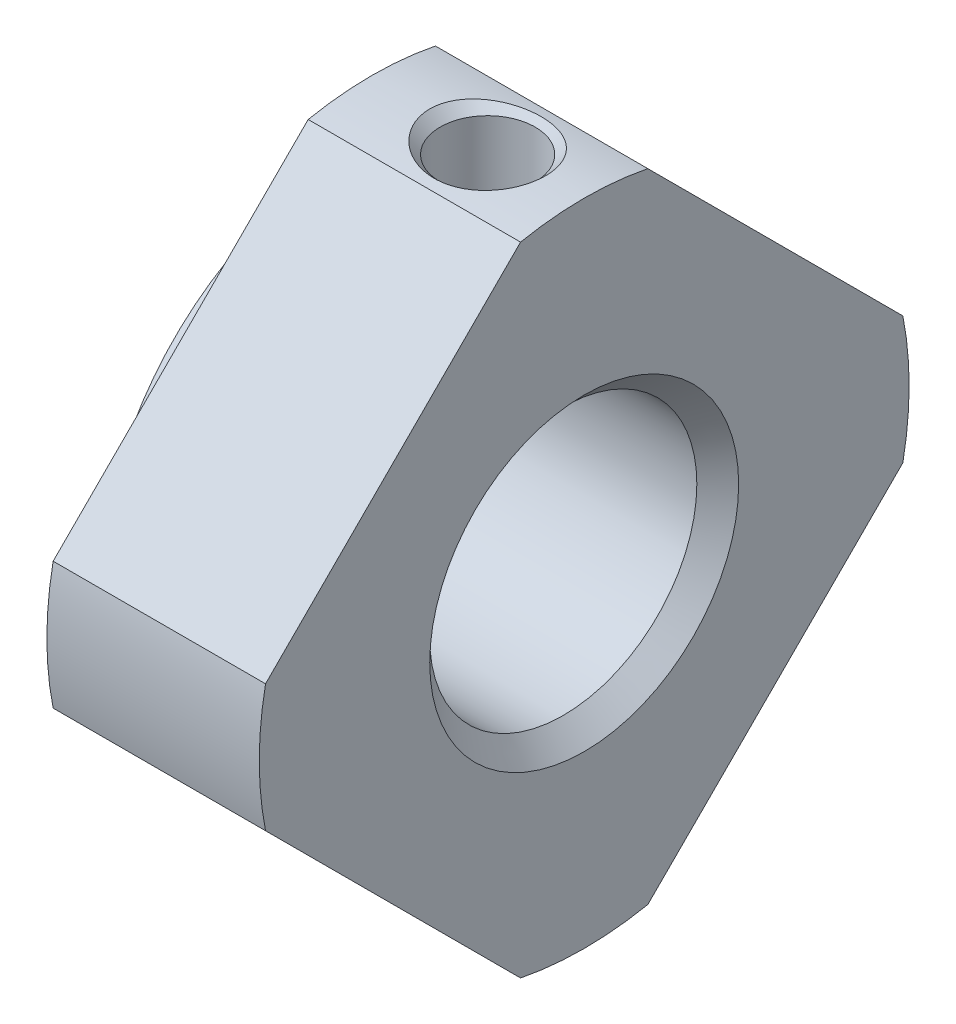
ISO-10303-21;
HEADER;
FILE_DESCRIPTION(('STEP AP214'),'2;1');
FILE_NAME('part.step','',(''),(''),'','','');
FILE_SCHEMA(('AUTOMOTIVE_DESIGN { 1 0 10303 214 1 1 1 1 }'));
ENDSEC;
DATA;
#1=APPLICATION_CONTEXT('core data for automotive mechanical design processes');
#2=APPLICATION_PROTOCOL_DEFINITION('international standard','automotive_design',2000,#1);
#3=PRODUCT_CONTEXT('',#1,'mechanical');
#4=PRODUCT('Part','Part','',(#3));
#5=PRODUCT_RELATED_PRODUCT_CATEGORY('part','',(#4));
#6=PRODUCT_DEFINITION_FORMATION('','',#4);
#7=PRODUCT_DEFINITION_CONTEXT('part definition',#1,'design');
#8=PRODUCT_DEFINITION('design','',#6,#7);
#9=PRODUCT_DEFINITION_SHAPE('','',#8);
#10=(LENGTH_UNIT() NAMED_UNIT(*) SI_UNIT(.MILLI.,.METRE.));
#11=(NAMED_UNIT(*) PLANE_ANGLE_UNIT() SI_UNIT($,.RADIAN.));
#12=(NAMED_UNIT(*) SI_UNIT($,.STERADIAN.) SOLID_ANGLE_UNIT());
#13=UNCERTAINTY_MEASURE_WITH_UNIT(LENGTH_MEASURE(1.E-05),#10,'distance_accuracy_value','');
#14=(GEOMETRIC_REPRESENTATION_CONTEXT(3) GLOBAL_UNCERTAINTY_ASSIGNED_CONTEXT((#13)) GLOBAL_UNIT_ASSIGNED_CONTEXT((#10,
#11,#12)) REPRESENTATION_CONTEXT('',''));
#15=CARTESIAN_POINT('',(0.,0.,0.));
#16=DIRECTION('',(0.,0.,1.));
#17=DIRECTION('',(1.,0.,0.));
#18=AXIS2_PLACEMENT_3D('',#15,#16,#17);
#19=CARTESIAN_POINT('',(24.,2.29809703885628,-2.29809703885628));
#20=DIRECTION('',(-1.,0.,0.));
#21=DIRECTION('',(0.,0.,1.));
#22=AXIS2_PLACEMENT_3D('',#19,#20,#21);
#23=PLANE('',#22);
#24=CARTESIAN_POINT('',(24.,0.,0.));
#25=DIRECTION('',(1.,0.,0.));
#26=DIRECTION('',(0.,0.,-1.));
#27=AXIS2_PLACEMENT_3D('',#24,#25,#26);
#28=CIRCLE('',#27,6.5);
#29=CARTESIAN_POINT('',(24.,0.,-6.5));
#30=VERTEX_POINT('',#29);
#31=EDGE_CURVE('E128',#30,#30,#28,.T.);
#32=ORIENTED_EDGE('',*,*,#31,.F.);
#33=EDGE_LOOP('',(#32));
#34=FACE_BOUND('',#33,.T.);
#35=CARTESIAN_POINT('',(24.0000000000578,0.,0.));
#36=DIRECTION('',(-1.,0.,0.));
#37=DIRECTION('',(0.,0.,1.));
#38=AXIS2_PLACEMENT_3D('',#35,#36,#37);
#39=CIRCLE('',#38,3.99999999999135);
#40=CARTESIAN_POINT('',(24.0000000000578,0.,3.99999999999135));
#41=VERTEX_POINT('',#40);
#42=EDGE_CURVE('E19',#41,#41,#39,.F.);
#43=ORIENTED_EDGE('',*,*,#42,.T.);
#44=EDGE_LOOP('',(#43));
#45=FACE_BOUND('',#44,.T.);
#46=ADVANCED_FACE('F16',(#34,#45),#23,.T.);
#47=CARTESIAN_POINT('',(24.0000000000578,0.,0.));
#48=DIRECTION('',(-1.,0.,0.));
#49=DIRECTION('',(0.,0.,1.));
#50=AXIS2_PLACEMENT_3D('',#47,#48,#49);
#51=CONICAL_SURFACE('',#50,3.99999999999135,0.785398163404676);
#52=CARTESIAN_POINT('',(24.5415,0.,0.));
#53=DIRECTION('',(1.,0.,0.));
#54=DIRECTION('',(0.,0.,-1.));
#55=AXIS2_PLACEMENT_3D('',#52,#53,#54);
#56=CIRCLE('',#55,3.4585);
#57=CARTESIAN_POINT('',(24.5415,0.,-3.4585));
#58=VERTEX_POINT('',#57);
#59=EDGE_CURVE('E126',#58,#58,#56,.T.);
#60=ORIENTED_EDGE('',*,*,#59,.T.);
#61=EDGE_LOOP('',(#60));
#62=FACE_BOUND('',#61,.T.);
#63=ORIENTED_EDGE('',*,*,#42,.F.);
#64=EDGE_LOOP('',(#63));
#65=FACE_BOUND('',#64,.T.);
#66=ADVANCED_FACE('F218',(#62,#65),#51,.F.);
#67=CARTESIAN_POINT('',(27.5,4.07203534805996,0.));
#68=DIRECTION('',(0.,-1.,0.));
#69=DIRECTION('',(0.,0.,-1.));
#70=AXIS2_PLACEMENT_3D('',#67,#68,#69);
#71=CYLINDRICAL_SURFACE('',#70,1.2295);
#72=CARTESIAN_POINT('',(28.7295,3.4585,0.));
#73=CARTESIAN_POINT('',(28.7294972532803,3.45849792901081,0.0667731705723019));
#74=CARTESIAN_POINT('',(28.724038134659,3.45654674055166,0.133577836929496));
#75=CARTESIAN_POINT('',(28.7024045018354,3.44894613652417,0.265241850890497));
#76=CARTESIAN_POINT('',(28.6862210016734,3.44329361965978,0.330099519426294));
#77=CARTESIAN_POINT('',(28.6437777582326,3.42890415188961,0.455894626995671));
#78=CARTESIAN_POINT('',(28.6175398105906,3.4201738760821,0.516840215139463));
#79=CARTESIAN_POINT('',(28.5558235340233,3.400509097644,0.63345225756244));
#80=CARTESIAN_POINT('',(28.5203444738172,3.3895744205871,0.689118293576919));
#81=CARTESIAN_POINT('',(28.4397084634739,3.36616491110564,0.795765124223505));
#82=CARTESIAN_POINT('',(28.3942561931314,3.35364956220271,0.846513677818602));
#83=CARTESIAN_POINT('',(28.2955905373628,3.32869957370831,0.939851074535168));
#84=CARTESIAN_POINT('',(28.2423749672851,3.31626495786794,0.982437612972421));
#85=CARTESIAN_POINT('',(28.1275158227201,3.29242672630858,1.05964105169358));
#86=CARTESIAN_POINT('',(28.0656496598687,3.28107159287441,1.09394324003043));
#87=CARTESIAN_POINT('',(27.9365581720018,3.2613001892905,1.1515545811353));
#88=CARTESIAN_POINT('',(27.8693347502231,3.25288288110636,1.17486761777019));
#89=CARTESIAN_POINT('',(27.7340917198755,3.2403693495768,1.20894543878393));
#90=CARTESIAN_POINT('',(27.6661970446325,3.23612257939152,1.22014900260984));
#91=CARTESIAN_POINT('',(27.5293688411667,3.23198796470078,1.23106191996937));
#92=CARTESIAN_POINT('',(27.4604356969162,3.23209854678288,1.23077542249103));
#93=CARTESIAN_POINT('',(27.3273662995864,3.23653530488158,1.21905432437841));
#94=CARTESIAN_POINT('',(27.2631692305767,3.24063810488675,1.20821042313127));
#95=CARTESIAN_POINT('',(27.1375732923528,3.25222856032938,1.17665256593067));
#96=CARTESIAN_POINT('',(27.0761748136911,3.25971668661784,1.15593723697959));
#97=CARTESIAN_POINT('',(26.9566480614102,3.27738039950413,1.10487030876405));
#98=CARTESIAN_POINT('',(26.8985967149501,3.28760112315905,1.07435494994134));
#99=CARTESIAN_POINT('',(26.7882627190975,3.30956085333351,1.00466954617846));
#100=CARTESIAN_POINT('',(26.7359816334106,3.32130026954647,0.965497163830239));
#101=CARTESIAN_POINT('',(26.6353818650582,3.34583228409178,0.876848941269146));
#102=CARTESIAN_POINT('',(26.5874867427625,3.35864589412237,0.826897229186064));
#103=CARTESIAN_POINT('',(26.500618524966,3.38327886557056,0.719498429300797));
#104=CARTESIAN_POINT('',(26.4616494332354,3.39509777931954,0.66204799601477));
#105=CARTESIAN_POINT('',(26.3933318281954,3.41660634979102,0.540273292543376));
#106=CARTESIAN_POINT('',(26.3641182604401,3.42626557413439,0.475867713273768));
#107=CARTESIAN_POINT('',(26.3171243795775,3.44212897844173,0.342695279100977));
#108=CARTESIAN_POINT('',(26.2993207958757,3.44834018712678,0.273937617159644));
#109=CARTESIAN_POINT('',(26.2818900730337,3.45446393024296,0.170440764568077));
#110=CARTESIAN_POINT('',(26.2776245751146,3.45597260725247,0.136516662067763));
#111=CARTESIAN_POINT('',(26.2719285589479,3.45799136740286,0.0684007779391334));
#112=CARTESIAN_POINT('',(26.2704980439418,3.45850144940194,0.0342089960047987));
#113=CARTESIAN_POINT('',(26.270503815498,3.45849717278851,-0.0667282579116665));
#114=CARTESIAN_POINT('',(26.2759579858041,3.45654803915553,-0.133522012986982));
#115=CARTESIAN_POINT('',(26.2975830028654,3.4489505922801,-0.265198067312143));
#116=CARTESIAN_POINT('',(26.3137709156948,3.4432963883434,-0.330077150475864));
#117=CARTESIAN_POINT('',(26.3562242731041,3.42890343483669,-0.455899064728556));
#118=CARTESIAN_POINT('',(26.3824650369959,3.42017224372993,-0.516851112274362));
#119=CARTESIAN_POINT('',(26.4441830338479,3.40050709248224,-0.633462928077768));
#120=CARTESIAN_POINT('',(26.4796592950033,3.38957336413056,-0.689123252315939));
#121=CARTESIAN_POINT('',(26.5602874489948,3.36616605876869,-0.795759744869848));
#122=CARTESIAN_POINT('',(26.6057345525074,3.35365197850508,-0.84650375759909));
#123=CARTESIAN_POINT('',(26.7043995687903,3.32870199987503,-0.939842881106358));
#124=CARTESIAN_POINT('',(26.7576211659347,3.31626614150923,-0.982434106000977));
#125=CARTESIAN_POINT('',(26.872509395562,3.29242109840042,-1.05965894098772));
#126=CARTESIAN_POINT('',(26.9344010058861,3.28106095286757,-1.09397416905596));
#127=CARTESIAN_POINT('',(27.0635104483576,3.26129255332198,-1.15157689373538));
#128=CARTESIAN_POINT('',(27.1307213970111,3.25288055840637,-1.17487837885786));
#129=CARTESIAN_POINT('',(27.2485165339642,3.24197650156783,-1.20456556549756));
#130=CARTESIAN_POINT('',(27.2982840502899,3.23847576468749,-1.21389504508542));
#131=CARTESIAN_POINT('',(27.3986949942306,3.2337749800511,-1.2263629946906));
#132=CARTESIAN_POINT('',(27.4493383208971,3.23257466890149,-1.22950217348457));
#133=CARTESIAN_POINT('',(27.5666230568127,3.23257932754768,-1.22949714174128));
#134=CARTESIAN_POINT('',(27.6332778519265,3.23466124573477,-1.22406169769771));
#135=CARTESIAN_POINT('',(27.7646297333065,3.24272545124204,-1.20253067989141));
#136=CARTESIAN_POINT('',(27.829325015771,3.24871122446087,-1.18642557858791));
#137=CARTESIAN_POINT('',(27.9547758487751,3.26381686880246,-1.14421099940331));
#138=CARTESIAN_POINT('',(28.0155408685309,3.27292884606487,-1.11812670070685));
#139=CARTESIAN_POINT('',(28.1318424619876,3.29324938071436,-1.05677387021534));
#140=CARTESIAN_POINT('',(28.1873785396001,3.30445813672953,-1.02150446819018));
#141=CARTESIAN_POINT('',(28.2941351726388,3.32827028660199,-0.941097155122366));
#142=CARTESIAN_POINT('',(28.345089820728,3.34091178009758,-0.895617391752426));
#143=CARTESIAN_POINT('',(28.4388427246348,3.3658477447303,-0.79679676389439));
#144=CARTESIAN_POINT('',(28.4816379752725,3.37814208659356,-0.743453015806719));
#145=CARTESIAN_POINT('',(28.5591044385083,3.40144759177939,-0.628427336918348));
#146=CARTESIAN_POINT('',(28.5934879281613,3.41240815681634,-0.566540653240623));
#147=CARTESIAN_POINT('',(28.6512185317241,3.4313419198717,-0.437438398122883));
#148=CARTESIAN_POINT('',(28.6745789212471,3.43931870897152,-0.370229351210259));
#149=CARTESIAN_POINT('',(28.7044054217375,3.4496397150729,-0.252285710907674));
#150=CARTESIAN_POINT('',(28.7137954674046,3.45294327339789,-0.202355400392088));
#151=CARTESIAN_POINT('',(28.7263435206443,3.45737410578969,-0.101622755274349));
#152=CARTESIAN_POINT('',(28.7295020905053,3.45850157621249,-0.0508204997682175));
#153=CARTESIAN_POINT('',(28.7295,3.4585,0.));
#154=B_SPLINE_CURVE_WITH_KNOTS('',3,(#72,#73,#74,#75,#76,#77,#78,#79,#80,#81,#82,#83,#84,#85,
#86,#87,#88,#89,#90,#91,#92,#93,#94,#95,#96,#97,#98,#99,#100,#101,#102,#103,#104,#105,#106,#107,
#108,#109,#110,#111,#112,#113,#114,#115,#116,#117,#118,#119,#120,#121,#122,#123,#124,#125,#126,
#127,#128,#129,#130,#131,#132,#133,#134,#135,#136,#137,#138,#139,#140,#141,#142,#143,#144,#145,
#146,#147,#148,#149,#150,#151,#152,#153),.UNSPECIFIED.,.T.,.F.,(4,2,2,2,2,2,2,2,2,2,2,2,2,2,2,2,
2,2,2,2,2,2,2,2,2,2,2,2,2,2,2,2,2,2,2,2,2,2,2,2,4),(0.,0.2001279857794,0.400423871193028,
0.600287997042275,0.800167943628057,1.00704524164594,1.21398086921195,1.42784762282295,
1.64163873329317,1.84739279914525,2.05307256918222,2.24786888036255,2.44269229329334,
2.64095724228983,2.83927578863519,3.04944697659925,3.25971225301992,3.47277600328787,
3.68540381670686,3.7879628857598,3.89052207207871,4.09057459144931,4.29094594872797,
4.49082849588913,4.69069001891412,4.89754730625148,5.104502944319,5.3184681305512,
5.53216082531669,5.68401679445202,5.83585537538258,6.03553194715906,6.23538706220654,
6.43474120010549,6.63411423241683,6.84156267863256,7.04908738301567,7.26294409436827,
7.47654258696946,7.62887206335164,7.78118779387252),.UNSPECIFIED.);
#155=CARTESIAN_POINT('',(28.7295,3.4585,0.));
#156=VERTEX_POINT('',#155);
#157=EDGE_CURVE('E125',#156,#156,#154,.T.);
#158=ORIENTED_EDGE('',*,*,#157,.T.);
#159=EDGE_LOOP('',(#158));
#160=FACE_BOUND('',#159,.T.);
#161=CARTESIAN_POINT('',(27.5,8.14407069606204,0.));
#162=DIRECTION('',(0.,1.,0.));
#163=DIRECTION('',(1.,0.,0.));
#164=AXIS2_PLACEMENT_3D('',#161,#162,#163);
#165=CIRCLE('',#164,1.22949999994034);
#166=CARTESIAN_POINT('',(28.7294999999403,8.14407069606204,0.));
#167=VERTEX_POINT('',#166);
#168=EDGE_CURVE('E122',#167,#167,#165,.T.);
#169=ORIENTED_EDGE('',*,*,#168,.T.);
#170=EDGE_LOOP('',(#169));
#171=FACE_BOUND('',#170,.T.);
#172=ADVANCED_FACE('F221',(#160,#171),#71,.F.);
#173=CARTESIAN_POINT('',(24.25,0.,0.));
#174=DIRECTION('',(1.,0.,0.));
#175=DIRECTION('',(0.,0.,-1.));
#176=AXIS2_PLACEMENT_3D('',#173,#174,#175);
#177=CYLINDRICAL_SURFACE('',#176,6.5);
#178=ORIENTED_EDGE('',*,*,#31,.T.);
#179=EDGE_LOOP('',(#178));
#180=FACE_BOUND('',#179,.T.);
#181=CARTESIAN_POINT('',(24.5,0.,0.));
#182=DIRECTION('',(1.,0.,0.));
#183=DIRECTION('',(0.,0.,-1.));
#184=AXIS2_PLACEMENT_3D('',#181,#182,#183);
#185=CIRCLE('',#184,6.5);
#186=CARTESIAN_POINT('',(24.5,0.,-6.5));
#187=VERTEX_POINT('',#186);
#188=EDGE_CURVE('E121',#187,#187,#185,.T.);
#189=ORIENTED_EDGE('',*,*,#188,.F.);
#190=EDGE_LOOP('',(#189));
#191=FACE_BOUND('',#190,.T.);
#192=ADVANCED_FACE('F212',(#180,#191),#177,.T.);
#193=CARTESIAN_POINT('',(27.,0.,0.));
#194=DIRECTION('',(1.,0.,0.));
#195=DIRECTION('',(0.,0.,-1.));
#196=AXIS2_PLACEMENT_3D('',#193,#194,#195);
#197=CYLINDRICAL_SURFACE('',#196,3.4585);
#198=CARTESIAN_POINT('',(29.4584999999756,0.,0.));
#199=DIRECTION('',(1.,0.,0.));
#200=DIRECTION('',(0.,0.70710678117833,-0.707106781194765));
#201=AXIS2_PLACEMENT_3D('',#198,#199,#200);
#202=CIRCLE('',#201,3.45849999998644);
#203=CARTESIAN_POINT('',(29.4584999999756,2.44552880269566,-2.44552880275251));
#204=VERTEX_POINT('',#203);
#205=EDGE_CURVE('E115',#204,#204,#202,.T.);
#206=ORIENTED_EDGE('',*,*,#205,.T.);
#207=EDGE_LOOP('',(#206));
#208=FACE_BOUND('',#207,.T.);
#209=ORIENTED_EDGE('',*,*,#157,.F.);
#210=EDGE_LOOP('',(#209));
#211=FACE_BOUND('',#210,.T.);
#212=ORIENTED_EDGE('',*,*,#59,.F.);
#213=EDGE_LOOP('',(#212));
#214=FACE_BOUND('',#213,.T.);
#215=ADVANCED_FACE('F192',(#208,#211,#214),#197,.F.);
#216=CARTESIAN_POINT('',(27.5,8.41619369595037,0.));
#217=DIRECTION('',(0.,1.,0.));
#218=DIRECTION('',(0.,0.,1.));
#219=AXIS2_PLACEMENT_3D('',#216,#217,#218);
#220=CONICAL_SURFACE('',#219,1.50162299982867,0.785398163397448);
#221=ORIENTED_EDGE('',*,*,#168,.F.);
#222=EDGE_LOOP('',(#221));
#223=FACE_BOUND('',#222,.T.);
#224=CARTESIAN_POINT('',(28.9999999999982,8.41457069611991,0.));
#225=CARTESIAN_POINT('',(28.9999902634013,8.41456799800857,0.074642129056308));
#226=CARTESIAN_POINT('',(28.9933972776143,8.41356516564388,0.149365889602182));
#227=CARTESIAN_POINT('',(28.9672952219709,8.4096664970959,0.296589883068127));
#228=CARTESIAN_POINT('',(28.9477570766986,8.40676639975459,0.369084725304883));
#229=CARTESIAN_POINT('',(28.897797110846,8.39958373900764,0.506474742444062));
#230=CARTESIAN_POINT('',(28.8678971970176,8.39536829435643,0.5715644433938));
#231=CARTESIAN_POINT('',(28.7982640300876,8.3859607311955,0.696109068163341));
#232=CARTESIAN_POINT('',(28.7585347379957,8.38076900630561,0.755566248443076));
#233=CARTESIAN_POINT('',(28.6678537663505,8.36957260828114,0.871107640923128));
#234=CARTESIAN_POINT('',(28.6163678364953,8.36353773424782,0.926768981076624));
#235=CARTESIAN_POINT('',(28.5053779364112,8.35152349314025,1.02943350705764));
#236=CARTESIAN_POINT('',(28.4458702836478,8.34554415291549,1.07643269275044));
#237=CARTESIAN_POINT('',(28.3153687963381,8.33374270679312,1.16441594622871));
#238=CARTESIAN_POINT('',(28.2438354015427,8.32797233085831,1.20460729140951));
#239=CARTESIAN_POINT('',(28.0952683742144,8.31774996974431,1.27328073946239));
#240=CARTESIAN_POINT('',(28.0182331923709,8.31329835776199,1.301759528683));
#241=CARTESIAN_POINT('',(27.8557607572974,8.30594305812099,1.3479230058139));
#242=CARTESIAN_POINT('',(27.7700982033856,8.30315152237144,1.36483534123509));
#243=CARTESIAN_POINT('',(27.5971205808341,8.29987296726121,1.38463329899045));
#244=CARTESIAN_POINT('',(27.5098052273881,8.29938634877509,1.38751648135639));
#245=CARTESIAN_POINT('',(27.3335463543106,8.3007911378732,1.37908929676849));
#246=CARTESIAN_POINT('',(27.2446211296296,8.30274600424837,1.36740018297371));
#247=CARTESIAN_POINT('',(27.0700194292995,8.30891553766181,1.32939436243964));
#248=CARTESIAN_POINT('',(26.9843432735198,8.31313042658312,1.30307621945163));
#249=CARTESIAN_POINT('',(26.8190474853746,8.32330474655641,1.23641679530551));
#250=CARTESIAN_POINT('',(26.7394092682285,8.32925852578163,1.19612086702427));
#251=CARTESIAN_POINT('',(26.588435608692,8.34219504706974,1.10227765748103));
#252=CARTESIAN_POINT('',(26.5170987181971,8.34917760918611,1.04873269252471));
#253=CARTESIAN_POINT('',(26.3878081898804,8.36301611504121,0.931819404184903));
#254=CARTESIAN_POINT('',(26.329451416117,8.36986690915974,0.868897485766564));
#255=CARTESIAN_POINT('',(26.2251549907265,8.38282794768746,0.733355626644697));
#256=CARTESIAN_POINT('',(26.1792144711125,8.38893824384638,0.66073636438683));
#257=CARTESIAN_POINT('',(26.104902791213,8.39916869169347,0.513784257389367));
#258=CARTESIAN_POINT('',(26.0754630772795,8.40340466439058,0.439999451445284));
#259=CARTESIAN_POINT('',(26.0305560088628,8.4099677220359,0.288361212864941));
#260=CARTESIAN_POINT('',(26.015047998101,8.41230035956431,0.210520324956357));
#261=CARTESIAN_POINT('',(26.0022853406073,8.41422494468996,0.0881493699734052));
#262=CARTESIAN_POINT('',(25.9999942488784,8.41457228981547,0.044088925272761));
#263=CARTESIAN_POINT('',(26.0000097365987,8.41456799800857,-0.0746421290563099));
#264=CARTESIAN_POINT('',(26.0066027223857,8.41356516564388,-0.149365889602184));
#265=CARTESIAN_POINT('',(26.0327047780291,8.4096664970959,-0.296589883068128));
#266=CARTESIAN_POINT('',(26.0522429233014,8.40676639975459,-0.369084725304885));
#267=CARTESIAN_POINT('',(26.102202889154,8.39958373900764,-0.506474742444064));
#268=CARTESIAN_POINT('',(26.1321028029824,8.39536829435643,-0.571564443393802));
#269=CARTESIAN_POINT('',(26.2017359699124,8.3859607311955,-0.696109068163342));
#270=CARTESIAN_POINT('',(26.2414652620043,8.38076900630561,-0.755566248443078));
#271=CARTESIAN_POINT('',(26.3321462336495,8.36957260828114,-0.87110764092313));
#272=CARTESIAN_POINT('',(26.3836321635047,8.36353773424782,-0.926768981076626));
#273=CARTESIAN_POINT('',(26.4946220635888,8.35152349314025,-1.02943350705764));
#274=CARTESIAN_POINT('',(26.5541297163522,8.34554415291549,-1.07643269275044));
#275=CARTESIAN_POINT('',(26.6846312036619,8.33374270679312,-1.16441594622871));
#276=CARTESIAN_POINT('',(26.7561645984573,8.32797233085831,-1.20460729140951));
#277=CARTESIAN_POINT('',(26.9047316257856,8.31774996974431,-1.27328073946239));
#278=CARTESIAN_POINT('',(26.9817668076291,8.31329835776199,-1.301759528683));
#279=CARTESIAN_POINT('',(27.1442392427026,8.30594305812099,-1.3479230058139));
#280=CARTESIAN_POINT('',(27.2299017966144,8.30315152237144,-1.36483534123509));
#281=CARTESIAN_POINT('',(27.4028794191659,8.29987296726121,-1.38463329899045));
#282=CARTESIAN_POINT('',(27.4901947726119,8.29938634877509,-1.38751648135639));
#283=CARTESIAN_POINT('',(27.6664536456894,8.3007911378732,-1.37908929676849));
#284=CARTESIAN_POINT('',(27.7553788703704,8.30274600424837,-1.36740018297371));
#285=CARTESIAN_POINT('',(27.9299805707005,8.30891553766181,-1.32939436243964));
#286=CARTESIAN_POINT('',(28.0156567264802,8.31313042658312,-1.30307621945163));
#287=CARTESIAN_POINT('',(28.1809525146254,8.32330474655641,-1.23641679530551));
#288=CARTESIAN_POINT('',(28.2605907317715,8.32925852578163,-1.19612086702427));
#289=CARTESIAN_POINT('',(28.411564391308,8.34219504706974,-1.10227765748103));
#290=CARTESIAN_POINT('',(28.4829012818029,8.34917760918611,-1.04873269252471));
#291=CARTESIAN_POINT('',(28.6121918101196,8.36301611504121,-0.931819404184903));
#292=CARTESIAN_POINT('',(28.670548583883,8.36986690915974,-0.868897485766564));
#293=CARTESIAN_POINT('',(28.7748450092735,8.38282794768746,-0.733355626644696));
#294=CARTESIAN_POINT('',(28.8207855288876,8.38893824384638,-0.660736364386829));
#295=CARTESIAN_POINT('',(28.895097208787,8.39916869169347,-0.513784257389365));
#296=CARTESIAN_POINT('',(28.9245369227205,8.40340466439058,-0.439999451445282));
#297=CARTESIAN_POINT('',(28.9694439911372,8.4099677220359,-0.28836121286494));
#298=CARTESIAN_POINT('',(28.984952001899,8.41230035956431,-0.210520324956356));
#299=CARTESIAN_POINT('',(28.9977146593927,8.41422494468996,-0.0881493699734055));
#300=CARTESIAN_POINT('',(29.0000057511216,8.41457228981547,-0.0440889252727621));
#301=CARTESIAN_POINT('',(28.9999999999982,8.41457069611991,0.));
#302=B_SPLINE_CURVE_WITH_KNOTS('',3,(#224,#225,#226,#227,#228,#229,#230,#231,#232,#233,#234,
#235,#236,#237,#238,#239,#240,#241,#242,#243,#244,#245,#246,#247,#248,#249,#250,#251,#252,#253,
#254,#255,#256,#257,#258,#259,#260,#261,#262,#263,#264,#265,#266,#267,#268,#269,#270,#271,#272,
#273,#274,#275,#276,#277,#278,#279,#280,#281,#282,#283,#284,#285,#286,#287,#288,#289,#290,#291,
#292,#293,#294,#295,#296,#297,#298,#299,#300,#301),.UNSPECIFIED.,.T.,.F.,(4,2,2,2,2,2,2,2,2,2,2,
2,2,2,2,2,2,2,2,2,2,2,2,2,2,2,2,2,2,2,2,2,2,2,2,2,2,2,4),(0.,0.223778027198478,
0.448060381616423,0.662381847263746,0.876617086641877,1.1038374521609,1.33116248529811,
1.57685304791683,1.82261307221293,2.08350111151392,2.3444345231747,2.61229345697315,
2.88017869327008,3.14720274540001,3.41418014713003,3.67109324375556,3.92798837563233,
4.16539258810183,4.40210172228628,4.53428086620375,4.75805889340222,4.98234124782017,
5.19666271346749,5.41089795284562,5.63811831836465,5.86544335150186,6.11113391412058,
6.35689393841667,6.61778197771766,6.87871538937845,7.1465743231769,7.41445955947383,
7.68148361160376,7.94846101333378,8.2053741099593,8.46226924183609,8.69967345430558,
8.93638258849003,9.06856173240749),.UNSPECIFIED.);
#303=CARTESIAN_POINT('',(28.9999999999982,8.41457069611991,0.));
#304=VERTEX_POINT('',#303);
#305=EDGE_CURVE('E149',#304,#304,#302,.T.);
#306=ORIENTED_EDGE('',*,*,#305,.F.);
#307=EDGE_LOOP('',(#306));
#308=FACE_BOUND('',#307,.T.);
#309=ADVANCED_FACE('F156',(#223,#308),#220,.F.);
#310=CARTESIAN_POINT('',(24.5,5.27309703885628,-5.27309703885628));
#311=DIRECTION('',(-1.,0.,0.));
#312=DIRECTION('',(0.,0.,1.));
#313=AXIS2_PLACEMENT_3D('',#310,#311,#312);
#314=PLANE('',#313);
#315=ORIENTED_EDGE('',*,*,#188,.T.);
#316=EDGE_LOOP('',(#315));
#317=FACE_BOUND('',#316,.T.);
#318=DIRECTION('',(0.,-0.707106781186548,0.707106781186547));
#319=VECTOR('',#318,1.);
#320=CARTESIAN_POINT('',(24.5,-9.89949493661166,0.));
#321=LINE('',#320,#319);
#322=CARTESIAN_POINT('',(24.5,-1.64785407208601,-8.25164086452564));
#323=VERTEX_POINT('',#322);
#324=CARTESIAN_POINT('',(24.5,-8.25164086452564,-1.64785407208602));
#325=VERTEX_POINT('',#324);
#326=EDGE_CURVE('E82',#323,#325,#321,.T.);
#327=ORIENTED_EDGE('',*,*,#326,.T.);
#328=CARTESIAN_POINT('',(24.5,0.,0.));
#329=DIRECTION('',(1.,0.,0.));
#330=DIRECTION('',(0.,0.,-1.));
#331=AXIS2_PLACEMENT_3D('',#328,#329,#330);
#332=CIRCLE('',#331,8.41457069611991);
#333=CARTESIAN_POINT('',(24.5,-8.25164086452564,1.64785407208601));
#334=VERTEX_POINT('',#333);
#335=EDGE_CURVE('E85',#334,#325,#332,.T.);
#336=ORIENTED_EDGE('',*,*,#335,.F.);
#337=DIRECTION('',(0.,0.707106781186547,0.707106781186548));
#338=VECTOR('',#337,1.);
#339=CARTESIAN_POINT('',(24.5,0.,9.89949493661166));
#340=LINE('',#339,#338);
#341=CARTESIAN_POINT('',(24.5,-1.64785407208602,8.25164086452564));
#342=VERTEX_POINT('',#341);
#343=EDGE_CURVE('E77',#334,#342,#340,.T.);
#344=ORIENTED_EDGE('',*,*,#343,.T.);
#345=CARTESIAN_POINT('',(24.5,0.,0.));
#346=DIRECTION('',(1.,0.,0.));
#347=DIRECTION('',(0.,0.,-1.));
#348=AXIS2_PLACEMENT_3D('',#345,#346,#347);
#349=CIRCLE('',#348,8.41457069611991);
#350=CARTESIAN_POINT('',(24.5,1.64785407208601,8.25164086452564));
#351=VERTEX_POINT('',#350);
#352=EDGE_CURVE('E143',#351,#342,#349,.T.);
#353=ORIENTED_EDGE('',*,*,#352,.F.);
#354=DIRECTION('',(0.,0.707106781186548,-0.707106781186547));
#355=VECTOR('',#354,1.);
#356=CARTESIAN_POINT('',(24.5,9.89949493661166,0.));
#357=LINE('',#356,#355);
#358=CARTESIAN_POINT('',(24.5,8.25164086452564,1.64785407208602));
#359=VERTEX_POINT('',#358);
#360=EDGE_CURVE('E110',#351,#359,#357,.T.);
#361=ORIENTED_EDGE('',*,*,#360,.T.);
#362=CARTESIAN_POINT('',(24.5,0.,0.));
#363=DIRECTION('',(1.,0.,0.));
#364=DIRECTION('',(0.,0.,-1.));
#365=AXIS2_PLACEMENT_3D('',#362,#363,#364);
#366=CIRCLE('',#365,8.41457069611991);
#367=CARTESIAN_POINT('',(24.5,8.25164086452564,-1.64785407208601));
#368=VERTEX_POINT('',#367);
#369=EDGE_CURVE('E113',#368,#359,#366,.T.);
#370=ORIENTED_EDGE('',*,*,#369,.F.);
#371=DIRECTION('',(0.,-0.707106781186547,-0.707106781186548));
#372=VECTOR('',#371,1.);
#373=CARTESIAN_POINT('',(24.5,0.,-9.89949493661166));
#374=LINE('',#373,#372);
#375=CARTESIAN_POINT('',(24.5,1.64785407208602,-8.25164086452564));
#376=VERTEX_POINT('',#375);
#377=EDGE_CURVE('E116',#368,#376,#374,.T.);
#378=ORIENTED_EDGE('',*,*,#377,.T.);
#379=CARTESIAN_POINT('',(24.5,0.,0.));
#380=DIRECTION('',(1.,0.,0.));
#381=DIRECTION('',(0.,0.,-1.));
#382=AXIS2_PLACEMENT_3D('',#379,#380,#381);
#383=CIRCLE('',#382,8.41457069611991);
#384=EDGE_CURVE('E88',#323,#376,#383,.T.);
#385=ORIENTED_EDGE('',*,*,#384,.F.);
#386=EDGE_LOOP('',(#327,#336,#344,#353,#361,#370,#378,#385));
#387=FACE_BOUND('',#386,.T.);
#388=ADVANCED_FACE('F84',(#317,#387),#314,.T.);
#389=CARTESIAN_POINT('',(29.9999999999727,0.,0.));
#390=DIRECTION('',(1.,0.,0.));
#391=DIRECTION('',(0.,0.,-1.));
#392=AXIS2_PLACEMENT_3D('',#389,#390,#391);
#393=CONICAL_SURFACE('',#392,3.99999999999135,0.785398163404676);
#394=CARTESIAN_POINT('',(29.9999999999727,0.,0.));
#395=DIRECTION('',(1.,0.,0.));
#396=DIRECTION('',(0.,0.,-1.));
#397=AXIS2_PLACEMENT_3D('',#394,#395,#396);
#398=CIRCLE('',#397,3.99999999999135);
#399=CARTESIAN_POINT('',(29.9999999999727,0.,-3.99999999999135));
#400=VERTEX_POINT('',#399);
#401=EDGE_CURVE('E140',#400,#400,#398,.F.);
#402=ORIENTED_EDGE('',*,*,#401,.F.);
#403=EDGE_LOOP('',(#402));
#404=FACE_BOUND('',#403,.T.);
#405=ORIENTED_EDGE('',*,*,#205,.F.);
#406=EDGE_LOOP('',(#405));
#407=FACE_BOUND('',#406,.T.);
#408=ADVANCED_FACE('F183',(#404,#407),#393,.F.);
#409=CARTESIAN_POINT('',(24.,0.,9.89949493661166));
#410=DIRECTION('',(0.,0.707106781186548,-0.707106781186547));
#411=DIRECTION('',(0.,0.707106781186547,0.707106781186548));
#412=AXIS2_PLACEMENT_3D('',#409,#410,#411);
#413=PLANE('',#412);
#414=DIRECTION('',(1.,0.,0.));
#415=VECTOR('',#414,1.);
#416=CARTESIAN_POINT('',(27.25,-1.64785407208602,8.25164086452564));
#417=LINE('',#416,#415);
#418=CARTESIAN_POINT('',(30.,-1.64785407208602,8.25164086452564));
#419=VERTEX_POINT('',#418);
#420=EDGE_CURVE('E393',#342,#419,#417,.T.);
#421=ORIENTED_EDGE('',*,*,#420,.F.);
#422=ORIENTED_EDGE('',*,*,#343,.F.);
#423=DIRECTION('',(1.,0.,0.));
#424=VECTOR('',#423,1.);
#425=CARTESIAN_POINT('',(27.25,-8.25164086452564,1.64785407208602));
#426=LINE('',#425,#424);
#427=CARTESIAN_POINT('',(30.,-8.25164086452564,1.64785407208602));
#428=VERTEX_POINT('',#427);
#429=EDGE_CURVE('E98',#428,#334,#426,.F.);
#430=ORIENTED_EDGE('',*,*,#429,.F.);
#431=DIRECTION('',(0.,-0.707106781186547,-0.707106781186547));
#432=VECTOR('',#431,1.);
#433=CARTESIAN_POINT('',(30.,-1.64785407208602,8.25164086452564));
#434=LINE('',#433,#432);
#435=EDGE_CURVE('E139',#419,#428,#434,.T.);
#436=ORIENTED_EDGE('',*,*,#435,.F.);
#437=EDGE_LOOP('',(#421,#422,#430,#436));
#438=FACE_BOUND('',#437,.T.);
#439=ADVANCED_FACE('F180',(#438),#413,.F.);
#440=CARTESIAN_POINT('',(27.25,0.,0.));
#441=DIRECTION('',(1.,0.,0.));
#442=DIRECTION('',(0.,0.,-1.));
#443=AXIS2_PLACEMENT_3D('',#440,#441,#442);
#444=CYLINDRICAL_SURFACE('',#443,8.41457069611991);
#445=DIRECTION('',(1.,0.,0.));
#446=VECTOR('',#445,1.);
#447=CARTESIAN_POINT('',(24.,-8.25164086452564,-1.64785407208602));
#448=LINE('',#447,#446);
#449=CARTESIAN_POINT('',(30.,-8.25164086452564,-1.64785407208602));
#450=VERTEX_POINT('',#449);
#451=EDGE_CURVE('E92',#325,#450,#448,.T.);
#452=ORIENTED_EDGE('',*,*,#451,.T.);
#453=CARTESIAN_POINT('',(30.,0.,0.));
#454=DIRECTION('',(1.,0.,0.));
#455=DIRECTION('',(0.,0.,-1.));
#456=AXIS2_PLACEMENT_3D('',#453,#454,#455);
#457=CIRCLE('',#456,8.41457069611991);
#458=EDGE_CURVE('E137',#428,#450,#457,.T.);
#459=ORIENTED_EDGE('',*,*,#458,.F.);
#460=ORIENTED_EDGE('',*,*,#429,.T.);
#461=ORIENTED_EDGE('',*,*,#335,.T.);
#462=EDGE_LOOP('',(#452,#459,#460,#461));
#463=FACE_BOUND('',#462,.T.);
#464=ADVANCED_FACE('F95',(#463),#444,.T.);
#465=CARTESIAN_POINT('',(24.,-9.89949493661166,0.));
#466=DIRECTION('',(0.,0.707106781186547,0.707106781186548));
#467=DIRECTION('',(0.,-0.707106781186548,0.707106781186547));
#468=AXIS2_PLACEMENT_3D('',#465,#466,#467);
#469=PLANE('',#468);
#470=ORIENTED_EDGE('',*,*,#451,.F.);
#471=ORIENTED_EDGE('',*,*,#326,.F.);
#472=DIRECTION('',(1.,0.,0.));
#473=VECTOR('',#472,1.);
#474=CARTESIAN_POINT('',(27.25,-1.64785407208602,-8.25164086452564));
#475=LINE('',#474,#473);
#476=CARTESIAN_POINT('',(30.,-1.64785407208602,-8.25164086452564));
#477=VERTEX_POINT('',#476);
#478=EDGE_CURVE('E104',#477,#323,#475,.F.);
#479=ORIENTED_EDGE('',*,*,#478,.F.);
#480=DIRECTION('',(0.,0.707106781186547,-0.707106781186547));
#481=VECTOR('',#480,1.);
#482=CARTESIAN_POINT('',(30.,-8.25164086452564,-1.64785407208602));
#483=LINE('',#482,#481);
#484=EDGE_CURVE('E102',#450,#477,#483,.T.);
#485=ORIENTED_EDGE('',*,*,#484,.F.);
#486=EDGE_LOOP('',(#470,#471,#479,#485));
#487=FACE_BOUND('',#486,.T.);
#488=ADVANCED_FACE('F100',(#487),#469,.F.);
#489=CARTESIAN_POINT('',(27.25,0.,0.));
#490=DIRECTION('',(1.,0.,0.));
#491=DIRECTION('',(0.,0.,-1.));
#492=AXIS2_PLACEMENT_3D('',#489,#490,#491);
#493=CYLINDRICAL_SURFACE('',#492,8.41457069611991);
#494=DIRECTION('',(1.,0.,0.));
#495=VECTOR('',#494,1.);
#496=CARTESIAN_POINT('',(24.,1.64785407208602,-8.25164086452564));
#497=LINE('',#496,#495);
#498=CARTESIAN_POINT('',(30.,1.64785407208602,-8.25164086452564));
#499=VERTEX_POINT('',#498);
#500=EDGE_CURVE('E117',#376,#499,#497,.T.);
#501=ORIENTED_EDGE('',*,*,#500,.T.);
#502=CARTESIAN_POINT('',(30.,0.,0.));
#503=DIRECTION('',(1.,0.,0.));
#504=DIRECTION('',(0.,0.,-1.));
#505=AXIS2_PLACEMENT_3D('',#502,#503,#504);
#506=CIRCLE('',#505,8.41457069611991);
#507=EDGE_CURVE('E134',#477,#499,#506,.T.);
#508=ORIENTED_EDGE('',*,*,#507,.F.);
#509=ORIENTED_EDGE('',*,*,#478,.T.);
#510=ORIENTED_EDGE('',*,*,#384,.T.);
#511=EDGE_LOOP('',(#501,#508,#509,#510));
#512=FACE_BOUND('',#511,.T.);
#513=ADVANCED_FACE('F171',(#512),#493,.T.);
#514=CARTESIAN_POINT('',(24.,0.,-9.89949493661166));
#515=DIRECTION('',(0.,-0.707106781186548,0.707106781186547));
#516=DIRECTION('',(0.,-0.707106781186547,-0.707106781186548));
#517=AXIS2_PLACEMENT_3D('',#514,#515,#516);
#518=PLANE('',#517);
#519=ORIENTED_EDGE('',*,*,#500,.F.);
#520=ORIENTED_EDGE('',*,*,#377,.F.);
#521=DIRECTION('',(1.,0.,0.));
#522=VECTOR('',#521,1.);
#523=CARTESIAN_POINT('',(27.25,8.25164086452564,-1.64785407208602));
#524=LINE('',#523,#522);
#525=CARTESIAN_POINT('',(30.,8.25164086452564,-1.64785407208602));
#526=VERTEX_POINT('',#525);
#527=EDGE_CURVE('E148',#526,#368,#524,.F.);
#528=ORIENTED_EDGE('',*,*,#527,.F.);
#529=DIRECTION('',(0.,0.707106781186547,0.707106781186547));
#530=VECTOR('',#529,1.);
#531=CARTESIAN_POINT('',(30.,1.64785407208602,-8.25164086452564));
#532=LINE('',#531,#530);
#533=EDGE_CURVE('E133',#499,#526,#532,.T.);
#534=ORIENTED_EDGE('',*,*,#533,.F.);
#535=EDGE_LOOP('',(#519,#520,#528,#534));
#536=FACE_BOUND('',#535,.T.);
#537=ADVANCED_FACE('F166',(#536),#518,.F.);
#538=CARTESIAN_POINT('',(27.25,0.,0.));
#539=DIRECTION('',(1.,0.,0.));
#540=DIRECTION('',(0.,0.,-1.));
#541=AXIS2_PLACEMENT_3D('',#538,#539,#540);
#542=CYLINDRICAL_SURFACE('',#541,8.41457069611991);
#543=DIRECTION('',(1.,0.,0.));
#544=VECTOR('',#543,1.);
#545=CARTESIAN_POINT('',(24.,8.25164086452564,1.64785407208602));
#546=LINE('',#545,#544);
#547=CARTESIAN_POINT('',(30.,8.25164086452564,1.64785407208602));
#548=VERTEX_POINT('',#547);
#549=EDGE_CURVE('E112',#359,#548,#546,.T.);
#550=ORIENTED_EDGE('',*,*,#549,.T.);
#551=CARTESIAN_POINT('',(30.,0.,0.));
#552=DIRECTION('',(1.,0.,0.));
#553=DIRECTION('',(0.,0.,-1.));
#554=AXIS2_PLACEMENT_3D('',#551,#552,#553);
#555=CIRCLE('',#554,8.41457069611991);
#556=EDGE_CURVE('E130',#526,#548,#555,.T.);
#557=ORIENTED_EDGE('',*,*,#556,.F.);
#558=ORIENTED_EDGE('',*,*,#527,.T.);
#559=ORIENTED_EDGE('',*,*,#369,.T.);
#560=EDGE_LOOP('',(#550,#557,#558,#559));
#561=FACE_BOUND('',#560,.T.);
#562=ORIENTED_EDGE('',*,*,#305,.T.);
#563=EDGE_LOOP('',(#562));
#564=FACE_BOUND('',#563,.T.);
#565=ADVANCED_FACE('F160',(#561,#564),#542,.T.);
#566=CARTESIAN_POINT('',(24.,9.89949493661166,0.));
#567=DIRECTION('',(0.,-0.707106781186547,-0.707106781186548));
#568=DIRECTION('',(0.,0.707106781186548,-0.707106781186547));
#569=AXIS2_PLACEMENT_3D('',#566,#567,#568);
#570=PLANE('',#569);
#571=ORIENTED_EDGE('',*,*,#549,.F.);
#572=ORIENTED_EDGE('',*,*,#360,.F.);
#573=DIRECTION('',(1.,0.,0.));
#574=VECTOR('',#573,1.);
#575=CARTESIAN_POINT('',(27.25,1.64785407208602,8.25164086452564));
#576=LINE('',#575,#574);
#577=CARTESIAN_POINT('',(30.,1.64785407208602,8.25164086452564));
#578=VERTEX_POINT('',#577);
#579=EDGE_CURVE('E34',#578,#351,#576,.F.);
#580=ORIENTED_EDGE('',*,*,#579,.F.);
#581=DIRECTION('',(0.,-0.707106781186547,0.707106781186547));
#582=VECTOR('',#581,1.);
#583=CARTESIAN_POINT('',(30.,8.25164086452564,1.64785407208602));
#584=LINE('',#583,#582);
#585=EDGE_CURVE('E25',#548,#578,#584,.T.);
#586=ORIENTED_EDGE('',*,*,#585,.F.);
#587=EDGE_LOOP('',(#571,#572,#580,#586));
#588=FACE_BOUND('',#587,.T.);
#589=ADVANCED_FACE('F165',(#588),#570,.F.);
#590=CARTESIAN_POINT('',(27.25,0.,0.));
#591=DIRECTION('',(1.,0.,0.));
#592=DIRECTION('',(0.,0.,-1.));
#593=AXIS2_PLACEMENT_3D('',#590,#591,#592);
#594=CYLINDRICAL_SURFACE('',#593,8.41457069611991);
#595=ORIENTED_EDGE('',*,*,#579,.T.);
#596=ORIENTED_EDGE('',*,*,#352,.T.);
#597=ORIENTED_EDGE('',*,*,#420,.T.);
#598=CARTESIAN_POINT('',(30.,0.,0.));
#599=DIRECTION('',(1.,0.,0.));
#600=DIRECTION('',(0.,0.,-1.));
#601=AXIS2_PLACEMENT_3D('',#598,#599,#600);
#602=CIRCLE('',#601,8.41457069611991);
#603=EDGE_CURVE('E10',#578,#419,#602,.T.);
#604=ORIENTED_EDGE('',*,*,#603,.F.);
#605=EDGE_LOOP('',(#595,#596,#597,#604));
#606=FACE_BOUND('',#605,.T.);
#607=ADVANCED_FACE('F197',(#606),#594,.T.);
#608=CARTESIAN_POINT('',(30.,2.975,-2.975));
#609=DIRECTION('',(1.,0.,0.));
#610=DIRECTION('',(0.,0.,-1.));
#611=AXIS2_PLACEMENT_3D('',#608,#609,#610);
#612=PLANE('',#611);
#613=ORIENTED_EDGE('',*,*,#585,.T.);
#614=ORIENTED_EDGE('',*,*,#603,.T.);
#615=ORIENTED_EDGE('',*,*,#435,.T.);
#616=ORIENTED_EDGE('',*,*,#458,.T.);
#617=ORIENTED_EDGE('',*,*,#484,.T.);
#618=ORIENTED_EDGE('',*,*,#507,.T.);
#619=ORIENTED_EDGE('',*,*,#533,.T.);
#620=ORIENTED_EDGE('',*,*,#556,.T.);
#621=EDGE_LOOP('',(#613,#614,#615,#616,#617,#618,#619,#620));
#622=FACE_BOUND('',#621,.T.);
#623=ORIENTED_EDGE('',*,*,#401,.T.);
#624=EDGE_LOOP('',(#623));
#625=FACE_BOUND('',#624,.T.);
#626=ADVANCED_FACE('F195',(#622,#625),#612,.T.);
#627=CLOSED_SHELL('',(#46,#66,#172,#192,#215,#309,#388,#408,#439,#464,#488,#513,#537,#565,#589,
#607,#626));
#628=MANIFOLD_SOLID_BREP('B1',#627);
#629=ADVANCED_BREP_SHAPE_REPRESENTATION('',(#18,#628),#14);
#630=SHAPE_DEFINITION_REPRESENTATION(#9,#629);
ENDSEC;
END-ISO-10303-21;
